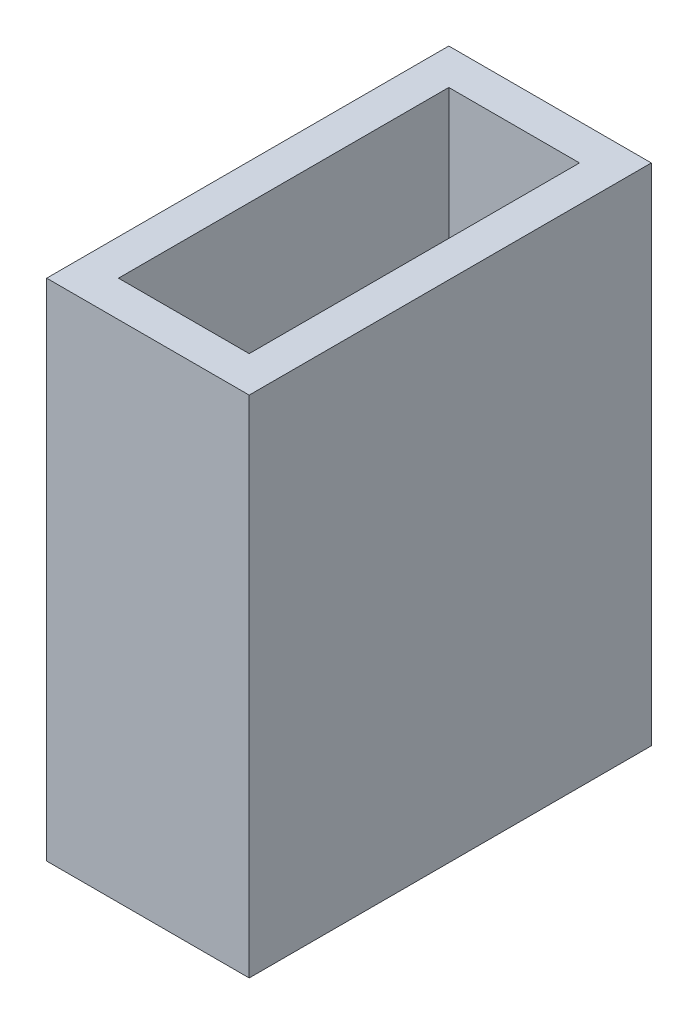
ISO-10303-21;
HEADER;
FILE_DESCRIPTION(('STEP AP214'),'2;1');
FILE_NAME('part.step','',(''),(''),'','','');
FILE_SCHEMA(('AUTOMOTIVE_DESIGN { 1 0 10303 214 1 1 1 1 }'));
ENDSEC;
DATA;
#1=APPLICATION_CONTEXT('core data for automotive mechanical design processes');
#2=APPLICATION_PROTOCOL_DEFINITION('international standard','automotive_design',2000,#1);
#3=PRODUCT_CONTEXT('',#1,'mechanical');
#4=PRODUCT('Part','Part','',(#3));
#5=PRODUCT_RELATED_PRODUCT_CATEGORY('part','',(#4));
#6=PRODUCT_DEFINITION_FORMATION('','',#4);
#7=PRODUCT_DEFINITION_CONTEXT('part definition',#1,'design');
#8=PRODUCT_DEFINITION('design','',#6,#7);
#9=PRODUCT_DEFINITION_SHAPE('','',#8);
#10=(LENGTH_UNIT() NAMED_UNIT(*) SI_UNIT(.MILLI.,.METRE.));
#11=(NAMED_UNIT(*) PLANE_ANGLE_UNIT() SI_UNIT($,.RADIAN.));
#12=(NAMED_UNIT(*) SI_UNIT($,.STERADIAN.) SOLID_ANGLE_UNIT());
#13=UNCERTAINTY_MEASURE_WITH_UNIT(LENGTH_MEASURE(1.E-05),#10,'distance_accuracy_value','');
#14=(GEOMETRIC_REPRESENTATION_CONTEXT(3) GLOBAL_UNCERTAINTY_ASSIGNED_CONTEXT((#13)) GLOBAL_UNIT_ASSIGNED_CONTEXT((#10,
#11,#12)) REPRESENTATION_CONTEXT('',''));
#15=CARTESIAN_POINT('',(0.,0.,0.));
#16=DIRECTION('',(0.,0.,1.));
#17=DIRECTION('',(1.,0.,0.));
#18=AXIS2_PLACEMENT_3D('',#15,#16,#17);
#19=CARTESIAN_POINT('',(14.5262229502912,2.17335897773504,-37.2709017363053));
#20=DIRECTION('',(0.,-1.,0.));
#21=DIRECTION('',(0.,0.,-1.));
#22=AXIS2_PLACEMENT_3D('',#19,#20,#21);
#23=PLANE('',#22);
#24=DIRECTION('',(1.,0.,0.));
#25=VECTOR('',#24,1.);
#26=CARTESIAN_POINT('',(13.7040842537851,2.17335897773504,-35.1934434793238));
#27=LINE('',#26,#25);
#28=CARTESIAN_POINT('',(13.7040842537851,2.17335897773504,-35.1934434793238));
#29=VERTEX_POINT('',#28);
#30=CARTESIAN_POINT('',(15.3483616467974,2.17335897773504,-35.1934434793238));
#31=VERTEX_POINT('',#30);
#32=EDGE_CURVE('E110',#29,#31,#27,.T.);
#33=ORIENTED_EDGE('',*,*,#32,.T.);
#34=DIRECTION('',(0.,0.,-1.));
#35=VECTOR('',#34,1.);
#36=CARTESIAN_POINT('',(15.3483616467974,2.17335897773504,-35.1934434793238));
#37=LINE('',#36,#35);
#38=CARTESIAN_POINT('',(15.3483616467974,2.17335897773504,-39.3483599932868));
#39=VERTEX_POINT('',#38);
#40=EDGE_CURVE('E117',#31,#39,#37,.T.);
#41=ORIENTED_EDGE('',*,*,#40,.T.);
#42=DIRECTION('',(-1.,0.,0.));
#43=VECTOR('',#42,1.);
#44=CARTESIAN_POINT('',(15.3483616467974,2.17335897773504,-39.3483599932868));
#45=LINE('',#44,#43);
#46=CARTESIAN_POINT('',(13.7040842537851,2.17335897773504,-39.3483599932868));
#47=VERTEX_POINT('',#46);
#48=EDGE_CURVE('E131',#39,#47,#45,.T.);
#49=ORIENTED_EDGE('',*,*,#48,.T.);
#50=DIRECTION('',(0.,0.,1.));
#51=VECTOR('',#50,1.);
#52=CARTESIAN_POINT('',(13.7040842537851,2.17335897773504,-39.3483599932868));
#53=LINE('',#52,#51);
#54=EDGE_CURVE('E157',#47,#29,#53,.T.);
#55=ORIENTED_EDGE('',*,*,#54,.T.);
#56=EDGE_LOOP('',(#33,#41,#49,#55));
#57=FACE_BOUND('',#56,.T.);
#58=DIRECTION('',(0.,0.,1.));
#59=VECTOR('',#58,1.);
#60=CARTESIAN_POINT('',(15.7999997114011,2.17335897773504,-34.7418054147201));
#61=LINE('',#60,#59);
#62=CARTESIAN_POINT('',(15.7999997114011,2.17335897773504,-39.7999980578905));
#63=VERTEX_POINT('',#62);
#64=CARTESIAN_POINT('',(15.7999997114011,2.17335897773504,-34.7418054147201));
#65=VERTEX_POINT('',#64);
#66=EDGE_CURVE('E11',#63,#65,#61,.T.);
#67=ORIENTED_EDGE('',*,*,#66,.T.);
#68=DIRECTION('',(-1.,0.,0.));
#69=VECTOR('',#68,1.);
#70=CARTESIAN_POINT('',(13.2524461891814,2.17335897773504,-34.7418054147201));
#71=LINE('',#70,#69);
#72=CARTESIAN_POINT('',(13.2524461891814,2.17335897773504,-34.7418054147201));
#73=VERTEX_POINT('',#72);
#74=EDGE_CURVE('E147',#65,#73,#71,.T.);
#75=ORIENTED_EDGE('',*,*,#74,.T.);
#76=DIRECTION('',(0.,0.,-1.));
#77=VECTOR('',#76,1.);
#78=CARTESIAN_POINT('',(13.2524461891814,2.17335897773504,-39.7999980578905));
#79=LINE('',#78,#77);
#80=CARTESIAN_POINT('',(13.2524461891814,2.17335897773504,-39.7999980578905));
#81=VERTEX_POINT('',#80);
#82=EDGE_CURVE('E158',#73,#81,#79,.T.);
#83=ORIENTED_EDGE('',*,*,#82,.T.);
#84=DIRECTION('',(1.,0.,0.));
#85=VECTOR('',#84,1.);
#86=CARTESIAN_POINT('',(15.7999997114011,2.17335897773504,-39.7999980578905));
#87=LINE('',#86,#85);
#88=EDGE_CURVE('E138',#81,#63,#87,.T.);
#89=ORIENTED_EDGE('',*,*,#88,.T.);
#90=EDGE_LOOP('',(#67,#75,#83,#89));
#91=FACE_BOUND('',#90,.T.);
#92=ADVANCED_FACE('F17',(#57,#91),#23,.T.);
#93=CARTESIAN_POINT('',(14.5262229502912,8.52335897075654,-37.2709017363053));
#94=DIRECTION('',(0.,1.,0.));
#95=DIRECTION('',(1.,0.,0.));
#96=AXIS2_PLACEMENT_3D('',#93,#94,#95);
#97=PLANE('',#96);
#98=DIRECTION('',(1.,0.,0.));
#99=VECTOR('',#98,1.);
#100=CARTESIAN_POINT('',(13.7040842537851,8.52335897075654,-35.1934434793238));
#101=LINE('',#100,#99);
#102=CARTESIAN_POINT('',(13.7040842537851,8.52335897075654,-35.1934434793238));
#103=VERTEX_POINT('',#102);
#104=CARTESIAN_POINT('',(15.3483616467974,8.52335897075654,-35.1934434793238));
#105=VERTEX_POINT('',#104);
#106=EDGE_CURVE('E98',#103,#105,#101,.T.);
#107=ORIENTED_EDGE('',*,*,#106,.F.);
#108=DIRECTION('',(0.,0.,1.));
#109=VECTOR('',#108,1.);
#110=CARTESIAN_POINT('',(13.7040842537851,8.52335897075654,-39.3483599932868));
#111=LINE('',#110,#109);
#112=CARTESIAN_POINT('',(13.7040842537851,8.52335897075654,-39.3483599932868));
#113=VERTEX_POINT('',#112);
#114=EDGE_CURVE('E21',#113,#103,#111,.T.);
#115=ORIENTED_EDGE('',*,*,#114,.F.);
#116=DIRECTION('',(-1.,0.,0.));
#117=VECTOR('',#116,1.);
#118=CARTESIAN_POINT('',(15.3483616467974,8.52335897075654,-39.3483599932868));
#119=LINE('',#118,#117);
#120=CARTESIAN_POINT('',(15.3483616467974,8.52335897075654,-39.3483599932868));
#121=VERTEX_POINT('',#120);
#122=EDGE_CURVE('E123',#121,#113,#119,.T.);
#123=ORIENTED_EDGE('',*,*,#122,.F.);
#124=DIRECTION('',(0.,0.,-1.));
#125=VECTOR('',#124,1.);
#126=CARTESIAN_POINT('',(15.3483616467974,8.52335897075654,-35.1934434793238));
#127=LINE('',#126,#125);
#128=EDGE_CURVE('E115',#105,#121,#127,.T.);
#129=ORIENTED_EDGE('',*,*,#128,.F.);
#130=EDGE_LOOP('',(#107,#115,#123,#129));
#131=FACE_BOUND('',#130,.T.);
#132=DIRECTION('',(0.,0.,-1.));
#133=VECTOR('',#132,1.);
#134=CARTESIAN_POINT('',(15.7999997114011,8.52335897075654,-34.7418054147201));
#135=LINE('',#134,#133);
#136=CARTESIAN_POINT('',(15.7999997114011,8.52335897075654,-34.7418054147201));
#137=VERTEX_POINT('',#136);
#138=CARTESIAN_POINT('',(15.7999997114011,8.52335897075654,-39.7999980578905));
#139=VERTEX_POINT('',#138);
#140=EDGE_CURVE('E28',#137,#139,#135,.T.);
#141=ORIENTED_EDGE('',*,*,#140,.T.);
#142=DIRECTION('',(-1.,0.,0.));
#143=VECTOR('',#142,1.);
#144=CARTESIAN_POINT('',(15.7999997114011,8.52335897075654,-39.7999980578905));
#145=LINE('',#144,#143);
#146=CARTESIAN_POINT('',(13.2524461891814,8.52335897075654,-39.7999980578905));
#147=VERTEX_POINT('',#146);
#148=EDGE_CURVE('E139',#139,#147,#145,.T.);
#149=ORIENTED_EDGE('',*,*,#148,.T.);
#150=DIRECTION('',(0.,0.,1.));
#151=VECTOR('',#150,1.);
#152=CARTESIAN_POINT('',(13.2524461891814,8.52335897075654,-39.7999980578905));
#153=LINE('',#152,#151);
#154=CARTESIAN_POINT('',(13.2524461891814,8.52335897075653,-34.7418054147201));
#155=VERTEX_POINT('',#154);
#156=EDGE_CURVE('E146',#147,#155,#153,.T.);
#157=ORIENTED_EDGE('',*,*,#156,.T.);
#158=DIRECTION('',(1.,0.,0.));
#159=VECTOR('',#158,1.);
#160=CARTESIAN_POINT('',(13.2524461891814,8.52335897075653,-34.7418054147201));
#161=LINE('',#160,#159);
#162=EDGE_CURVE('E151',#155,#137,#161,.T.);
#163=ORIENTED_EDGE('',*,*,#162,.T.);
#164=EDGE_LOOP('',(#141,#149,#157,#163));
#165=FACE_BOUND('',#164,.T.);
#166=ADVANCED_FACE('F121',(#131,#165),#97,.T.);
#167=CARTESIAN_POINT('',(15.7999997114011,8.52335897075654,-39.7999980578905));
#168=DIRECTION('',(1.,0.,0.));
#169=DIRECTION('',(0.,1.,0.));
#170=AXIS2_PLACEMENT_3D('',#167,#168,#169);
#171=PLANE('',#170);
#172=ORIENTED_EDGE('',*,*,#140,.F.);
#173=DIRECTION('',(0.,-1.,0.));
#174=VECTOR('',#173,1.);
#175=CARTESIAN_POINT('',(15.7999997114011,8.52335897075654,-34.7418054147201));
#176=LINE('',#175,#174);
#177=EDGE_CURVE('E150',#137,#65,#176,.T.);
#178=ORIENTED_EDGE('',*,*,#177,.T.);
#179=ORIENTED_EDGE('',*,*,#66,.F.);
#180=DIRECTION('',(0.,-1.,0.));
#181=VECTOR('',#180,1.);
#182=CARTESIAN_POINT('',(15.7999997114011,8.52335897075654,-39.7999980578905));
#183=LINE('',#182,#181);
#184=EDGE_CURVE('E134',#139,#63,#183,.T.);
#185=ORIENTED_EDGE('',*,*,#184,.F.);
#186=EDGE_LOOP('',(#172,#178,#179,#185));
#187=FACE_BOUND('',#186,.T.);
#188=ADVANCED_FACE('F213',(#187),#171,.T.);
#189=CARTESIAN_POINT('',(15.7999997114011,8.52335897075654,-34.7418054147201));
#190=DIRECTION('',(0.,0.,1.));
#191=DIRECTION('',(1.,0.,0.));
#192=AXIS2_PLACEMENT_3D('',#189,#190,#191);
#193=PLANE('',#192);
#194=ORIENTED_EDGE('',*,*,#162,.F.);
#195=DIRECTION('',(0.,-1.,0.));
#196=VECTOR('',#195,1.);
#197=CARTESIAN_POINT('',(13.2524461891814,8.52335897075653,-34.7418054147201));
#198=LINE('',#197,#196);
#199=EDGE_CURVE('E161',#155,#73,#198,.T.);
#200=ORIENTED_EDGE('',*,*,#199,.T.);
#201=ORIENTED_EDGE('',*,*,#74,.F.);
#202=ORIENTED_EDGE('',*,*,#177,.F.);
#203=EDGE_LOOP('',(#194,#200,#201,#202));
#204=FACE_BOUND('',#203,.T.);
#205=ADVANCED_FACE('F205',(#204),#193,.T.);
#206=CARTESIAN_POINT('',(13.2524461891814,8.52335897075654,-34.7418054147201));
#207=DIRECTION('',(-1.,0.,0.));
#208=DIRECTION('',(0.,1.,0.));
#209=AXIS2_PLACEMENT_3D('',#206,#207,#208);
#210=PLANE('',#209);
#211=ORIENTED_EDGE('',*,*,#156,.F.);
#212=DIRECTION('',(0.,-1.,0.));
#213=VECTOR('',#212,1.);
#214=CARTESIAN_POINT('',(13.2524461891814,8.52335897075654,-39.7999980578905));
#215=LINE('',#214,#213);
#216=EDGE_CURVE('E142',#147,#81,#215,.T.);
#217=ORIENTED_EDGE('',*,*,#216,.T.);
#218=ORIENTED_EDGE('',*,*,#82,.F.);
#219=ORIENTED_EDGE('',*,*,#199,.F.);
#220=EDGE_LOOP('',(#211,#217,#218,#219));
#221=FACE_BOUND('',#220,.T.);
#222=ADVANCED_FACE('F207',(#221),#210,.T.);
#223=CARTESIAN_POINT('',(13.2524461891814,8.52335897075653,-39.7999980578905));
#224=DIRECTION('',(0.,0.,-1.));
#225=DIRECTION('',(0.,-1.,0.));
#226=AXIS2_PLACEMENT_3D('',#223,#224,#225);
#227=PLANE('',#226);
#228=ORIENTED_EDGE('',*,*,#148,.F.);
#229=ORIENTED_EDGE('',*,*,#184,.T.);
#230=ORIENTED_EDGE('',*,*,#88,.F.);
#231=ORIENTED_EDGE('',*,*,#216,.F.);
#232=EDGE_LOOP('',(#228,#229,#230,#231));
#233=FACE_BOUND('',#232,.T.);
#234=ADVANCED_FACE('F211',(#233),#227,.T.);
#235=CARTESIAN_POINT('',(13.7040842537851,8.52335897075654,-35.1934434793238));
#236=DIRECTION('',(0.,0.,-1.));
#237=DIRECTION('',(0.,-1.,0.));
#238=AXIS2_PLACEMENT_3D('',#235,#236,#237);
#239=PLANE('',#238);
#240=ORIENTED_EDGE('',*,*,#106,.T.);
#241=DIRECTION('',(0.,-1.,0.));
#242=VECTOR('',#241,1.);
#243=CARTESIAN_POINT('',(15.3483616467974,8.52335897075654,-35.1934434793238));
#244=LINE('',#243,#242);
#245=EDGE_CURVE('E101',#105,#31,#244,.T.);
#246=ORIENTED_EDGE('',*,*,#245,.T.);
#247=ORIENTED_EDGE('',*,*,#32,.F.);
#248=DIRECTION('',(0.,-1.,0.));
#249=VECTOR('',#248,1.);
#250=CARTESIAN_POINT('',(13.7040842537851,8.52335897075654,-35.1934434793238));
#251=LINE('',#250,#249);
#252=EDGE_CURVE('E104',#103,#29,#251,.T.);
#253=ORIENTED_EDGE('',*,*,#252,.F.);
#254=EDGE_LOOP('',(#240,#246,#247,#253));
#255=FACE_BOUND('',#254,.T.);
#256=ADVANCED_FACE('F100',(#255),#239,.T.);
#257=CARTESIAN_POINT('',(15.3483616467974,8.52335897075654,-35.1934434793238));
#258=DIRECTION('',(-1.,0.,0.));
#259=DIRECTION('',(0.,1.,0.));
#260=AXIS2_PLACEMENT_3D('',#257,#258,#259);
#261=PLANE('',#260);
#262=ORIENTED_EDGE('',*,*,#128,.T.);
#263=DIRECTION('',(0.,-1.,0.));
#264=VECTOR('',#263,1.);
#265=CARTESIAN_POINT('',(15.3483616467974,8.52335897075654,-39.3483599932868));
#266=LINE('',#265,#264);
#267=EDGE_CURVE('E125',#121,#39,#266,.T.);
#268=ORIENTED_EDGE('',*,*,#267,.T.);
#269=ORIENTED_EDGE('',*,*,#40,.F.);
#270=ORIENTED_EDGE('',*,*,#245,.F.);
#271=EDGE_LOOP('',(#262,#268,#269,#270));
#272=FACE_BOUND('',#271,.T.);
#273=ADVANCED_FACE('F113',(#272),#261,.T.);
#274=CARTESIAN_POINT('',(15.3483616467974,8.52335897075654,-39.3483599932868));
#275=DIRECTION('',(0.,0.,1.));
#276=DIRECTION('',(1.,0.,0.));
#277=AXIS2_PLACEMENT_3D('',#274,#275,#276);
#278=PLANE('',#277);
#279=ORIENTED_EDGE('',*,*,#122,.T.);
#280=DIRECTION('',(0.,-1.,0.));
#281=VECTOR('',#280,1.);
#282=CARTESIAN_POINT('',(13.7040842537851,8.52335897075654,-39.3483599932868));
#283=LINE('',#282,#281);
#284=EDGE_CURVE('E154',#113,#47,#283,.T.);
#285=ORIENTED_EDGE('',*,*,#284,.T.);
#286=ORIENTED_EDGE('',*,*,#48,.F.);
#287=ORIENTED_EDGE('',*,*,#267,.F.);
#288=EDGE_LOOP('',(#279,#285,#286,#287));
#289=FACE_BOUND('',#288,.T.);
#290=ADVANCED_FACE('F272',(#289),#278,.T.);
#291=CARTESIAN_POINT('',(13.7040842537851,8.52335897075654,-39.3483599932868));
#292=DIRECTION('',(1.,0.,0.));
#293=DIRECTION('',(0.,1.,0.));
#294=AXIS2_PLACEMENT_3D('',#291,#292,#293);
#295=PLANE('',#294);
#296=ORIENTED_EDGE('',*,*,#114,.T.);
#297=ORIENTED_EDGE('',*,*,#252,.T.);
#298=ORIENTED_EDGE('',*,*,#54,.F.);
#299=ORIENTED_EDGE('',*,*,#284,.F.);
#300=EDGE_LOOP('',(#296,#297,#298,#299));
#301=FACE_BOUND('',#300,.T.);
#302=ADVANCED_FACE('F19',(#301),#295,.T.);
#303=CLOSED_SHELL('',(#92,#166,#188,#205,#222,#234,#256,#273,#290,#302));
#304=MANIFOLD_SOLID_BREP('B1',#303);
#305=ADVANCED_BREP_SHAPE_REPRESENTATION('',(#18,#304),#14);
#306=SHAPE_DEFINITION_REPRESENTATION(#9,#305);
ENDSEC;
END-ISO-10303-21;
